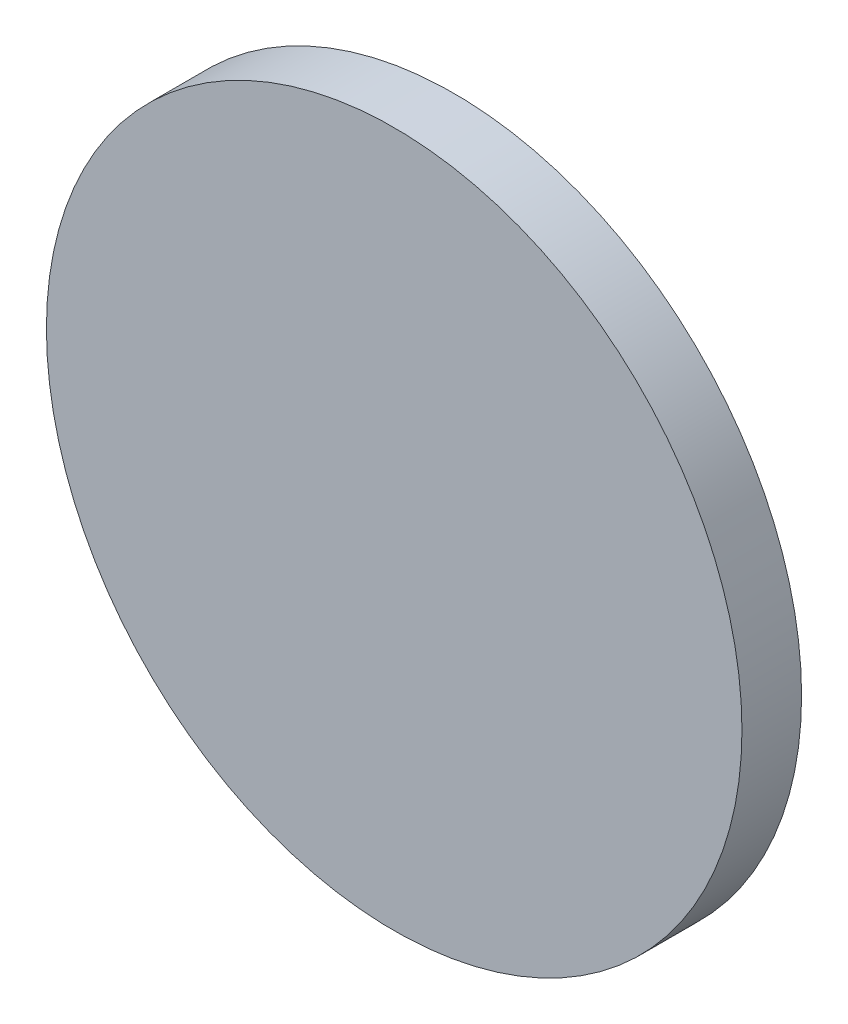
ISO-10303-21;
HEADER;
FILE_DESCRIPTION(('STEP AP214'),'2;1');
FILE_NAME('part.step','',(''),(''),'','','');
FILE_SCHEMA(('AUTOMOTIVE_DESIGN { 1 0 10303 214 1 1 1 1 }'));
ENDSEC;
DATA;
#1=APPLICATION_CONTEXT('core data for automotive mechanical design processes');
#2=APPLICATION_PROTOCOL_DEFINITION('international standard','automotive_design',2000,#1);
#3=PRODUCT_CONTEXT('',#1,'mechanical');
#4=PRODUCT('Part','Part','',(#3));
#5=PRODUCT_RELATED_PRODUCT_CATEGORY('part','',(#4));
#6=PRODUCT_DEFINITION_FORMATION('','',#4);
#7=PRODUCT_DEFINITION_CONTEXT('part definition',#1,'design');
#8=PRODUCT_DEFINITION('design','',#6,#7);
#9=PRODUCT_DEFINITION_SHAPE('','',#8);
#10=(LENGTH_UNIT() NAMED_UNIT(*) SI_UNIT(.MILLI.,.METRE.));
#11=(NAMED_UNIT(*) PLANE_ANGLE_UNIT() SI_UNIT($,.RADIAN.));
#12=(NAMED_UNIT(*) SI_UNIT($,.STERADIAN.) SOLID_ANGLE_UNIT());
#13=UNCERTAINTY_MEASURE_WITH_UNIT(LENGTH_MEASURE(1.E-05),#10,'distance_accuracy_value','');
#14=(GEOMETRIC_REPRESENTATION_CONTEXT(3) GLOBAL_UNCERTAINTY_ASSIGNED_CONTEXT((#13)) GLOBAL_UNIT_ASSIGNED_CONTEXT((#10,
#11,#12)) REPRESENTATION_CONTEXT('',''));
#15=CARTESIAN_POINT('',(0.,0.,0.));
#16=DIRECTION('',(0.,0.,1.));
#17=DIRECTION('',(1.,0.,0.));
#18=AXIS2_PLACEMENT_3D('',#15,#16,#17);
#19=CARTESIAN_POINT('',(2.413,6.794500006176,0.76487));
#20=DIRECTION('',(0.,0.,-1.));
#21=DIRECTION('',(-1.,0.,0.));
#22=AXIS2_PLACEMENT_3D('',#19,#20,#21);
#23=PLANE('',#22);
#24=CARTESIAN_POINT('',(2.413,6.794500006176,0.76487));
#25=DIRECTION('',(0.,0.,1.));
#26=DIRECTION('',(1.,0.,0.));
#27=AXIS2_PLACEMENT_3D('',#24,#25,#26);
#28=CIRCLE('',#27,0.200024667);
#29=CARTESIAN_POINT('',(2.613024667,6.794500006176,0.76487));
#30=VERTEX_POINT('',#29);
#31=EDGE_CURVE('E18',#30,#30,#28,.T.);
#32=ORIENTED_EDGE('',*,*,#31,.F.);
#33=EDGE_LOOP('',(#32));
#34=FACE_BOUND('',#33,.T.);
#35=ADVANCED_FACE('F15',(#34),#23,.T.);
#36=CARTESIAN_POINT('',(2.413,6.794500006176,0.76487));
#37=DIRECTION('',(0.,0.,1.));
#38=DIRECTION('',(1.,0.,0.));
#39=AXIS2_PLACEMENT_3D('',#36,#37,#38);
#40=CYLINDRICAL_SURFACE('',#39,0.200024667);
#41=CARTESIAN_POINT('',(2.413,6.794500006176,0.79916));
#42=DIRECTION('',(0.,0.,1.));
#43=DIRECTION('',(1.,0.,0.));
#44=AXIS2_PLACEMENT_3D('',#41,#42,#43);
#45=CIRCLE('',#44,0.200024667);
#46=CARTESIAN_POINT('',(2.613024667,6.794500006176,0.79916));
#47=VERTEX_POINT('',#46);
#48=EDGE_CURVE('E10',#47,#47,#45,.T.);
#49=ORIENTED_EDGE('',*,*,#48,.F.);
#50=EDGE_LOOP('',(#49));
#51=FACE_BOUND('',#50,.T.);
#52=ORIENTED_EDGE('',*,*,#31,.T.);
#53=EDGE_LOOP('',(#52));
#54=FACE_BOUND('',#53,.T.);
#55=ADVANCED_FACE('F27',(#51,#54),#40,.T.);
#56=CARTESIAN_POINT('',(2.413,6.794500006176,0.79916));
#57=DIRECTION('',(0.,0.,1.));
#58=DIRECTION('',(1.,0.,0.));
#59=AXIS2_PLACEMENT_3D('',#56,#57,#58);
#60=PLANE('',#59);
#61=ORIENTED_EDGE('',*,*,#48,.T.);
#62=EDGE_LOOP('',(#61));
#63=FACE_BOUND('',#62,.T.);
#64=ADVANCED_FACE('F34',(#63),#60,.T.);
#65=CLOSED_SHELL('',(#35,#55,#64));
#66=MANIFOLD_SOLID_BREP('B1',#65);
#67=ADVANCED_BREP_SHAPE_REPRESENTATION('',(#18,#66),#14);
#68=SHAPE_DEFINITION_REPRESENTATION(#9,#67);
ENDSEC;
END-ISO-10303-21;
